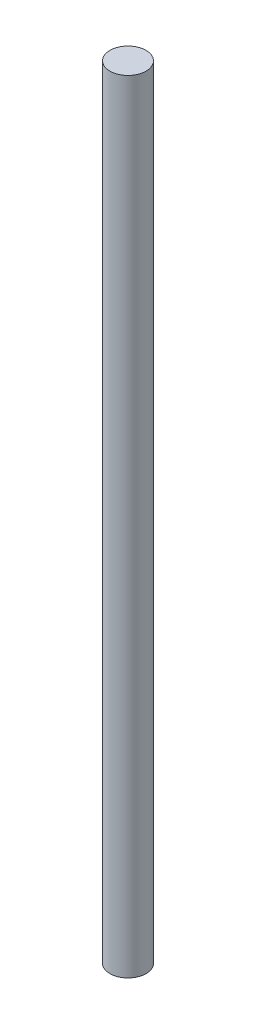
ISO-10303-21;
HEADER;
FILE_DESCRIPTION(('STEP AP214'),'2;1');
FILE_NAME('part.step','',(''),(''),'','','');
FILE_SCHEMA(('AUTOMOTIVE_DESIGN { 1 0 10303 214 1 1 1 1 }'));
ENDSEC;
DATA;
#1=APPLICATION_CONTEXT('core data for automotive mechanical design processes');
#2=APPLICATION_PROTOCOL_DEFINITION('international standard','automotive_design',2000,#1);
#3=PRODUCT_CONTEXT('',#1,'mechanical');
#4=PRODUCT('Part','Part','',(#3));
#5=PRODUCT_RELATED_PRODUCT_CATEGORY('part','',(#4));
#6=PRODUCT_DEFINITION_FORMATION('','',#4);
#7=PRODUCT_DEFINITION_CONTEXT('part definition',#1,'design');
#8=PRODUCT_DEFINITION('design','',#6,#7);
#9=PRODUCT_DEFINITION_SHAPE('','',#8);
#10=(LENGTH_UNIT() NAMED_UNIT(*) SI_UNIT(.MILLI.,.METRE.));
#11=(NAMED_UNIT(*) PLANE_ANGLE_UNIT() SI_UNIT($,.RADIAN.));
#12=(NAMED_UNIT(*) SI_UNIT($,.STERADIAN.) SOLID_ANGLE_UNIT());
#13=UNCERTAINTY_MEASURE_WITH_UNIT(LENGTH_MEASURE(1.E-05),#10,'distance_accuracy_value','');
#14=(GEOMETRIC_REPRESENTATION_CONTEXT(3) GLOBAL_UNCERTAINTY_ASSIGNED_CONTEXT((#13)) GLOBAL_UNIT_ASSIGNED_CONTEXT((#10,
#11,#12)) REPRESENTATION_CONTEXT('',''));
#15=CARTESIAN_POINT('',(0.,0.,0.));
#16=DIRECTION('',(0.,0.,1.));
#17=DIRECTION('',(1.,0.,0.));
#18=AXIS2_PLACEMENT_3D('',#15,#16,#17);
#19=CARTESIAN_POINT('',(0.,65.,0.));
#20=DIRECTION('',(0.,-1.,0.));
#21=DIRECTION('',(0.,0.,-1.));
#22=AXIS2_PLACEMENT_3D('',#19,#20,#21);
#23=CYLINDRICAL_SURFACE('',#22,1.5);
#24=CARTESIAN_POINT('',(0.,65.,0.));
#25=DIRECTION('',(0.,1.,0.));
#26=DIRECTION('',(0.,0.,1.));
#27=AXIS2_PLACEMENT_3D('',#24,#25,#26);
#28=CIRCLE('',#27,1.5);
#29=CARTESIAN_POINT('',(0.,65.,1.5));
#30=VERTEX_POINT('',#29);
#31=EDGE_CURVE('E10',#30,#30,#28,.T.);
#32=ORIENTED_EDGE('',*,*,#31,.F.);
#33=EDGE_LOOP('',(#32));
#34=FACE_BOUND('',#33,.T.);
#35=CARTESIAN_POINT('',(0.,0.,0.));
#36=DIRECTION('',(0.,1.,0.));
#37=DIRECTION('',(0.,0.,1.));
#38=AXIS2_PLACEMENT_3D('',#35,#36,#37);
#39=CIRCLE('',#38,1.5);
#40=CARTESIAN_POINT('',(0.,0.,1.5));
#41=VERTEX_POINT('',#40);
#42=EDGE_CURVE('E44',#41,#41,#39,.T.);
#43=ORIENTED_EDGE('',*,*,#42,.T.);
#44=EDGE_LOOP('',(#43));
#45=FACE_BOUND('',#44,.T.);
#46=ADVANCED_FACE('F41',(#34,#45),#23,.T.);
#47=CARTESIAN_POINT('',(0.,65.,0.));
#48=DIRECTION('',(0.,1.,0.));
#49=DIRECTION('',(0.,0.,1.));
#50=AXIS2_PLACEMENT_3D('',#47,#48,#49);
#51=PLANE('',#50);
#52=ORIENTED_EDGE('',*,*,#31,.T.);
#53=EDGE_LOOP('',(#52));
#54=FACE_BOUND('',#53,.T.);
#55=ADVANCED_FACE('F60',(#54),#51,.T.);
#56=CARTESIAN_POINT('',(0.,0.,0.));
#57=DIRECTION('',(0.,1.,0.));
#58=DIRECTION('',(0.,0.,1.));
#59=AXIS2_PLACEMENT_3D('',#56,#57,#58);
#60=PLANE('',#59);
#61=ORIENTED_EDGE('',*,*,#42,.F.);
#62=EDGE_LOOP('',(#61));
#63=FACE_BOUND('',#62,.T.);
#64=ADVANCED_FACE('F58',(#63),#60,.F.);
#65=CLOSED_SHELL('',(#46,#55,#64));
#66=MANIFOLD_SOLID_BREP('B2',#65);
#67=ADVANCED_BREP_SHAPE_REPRESENTATION('',(#18,#66),#14);
#68=SHAPE_DEFINITION_REPRESENTATION(#9,#67);
ENDSEC;
END-ISO-10303-21;
